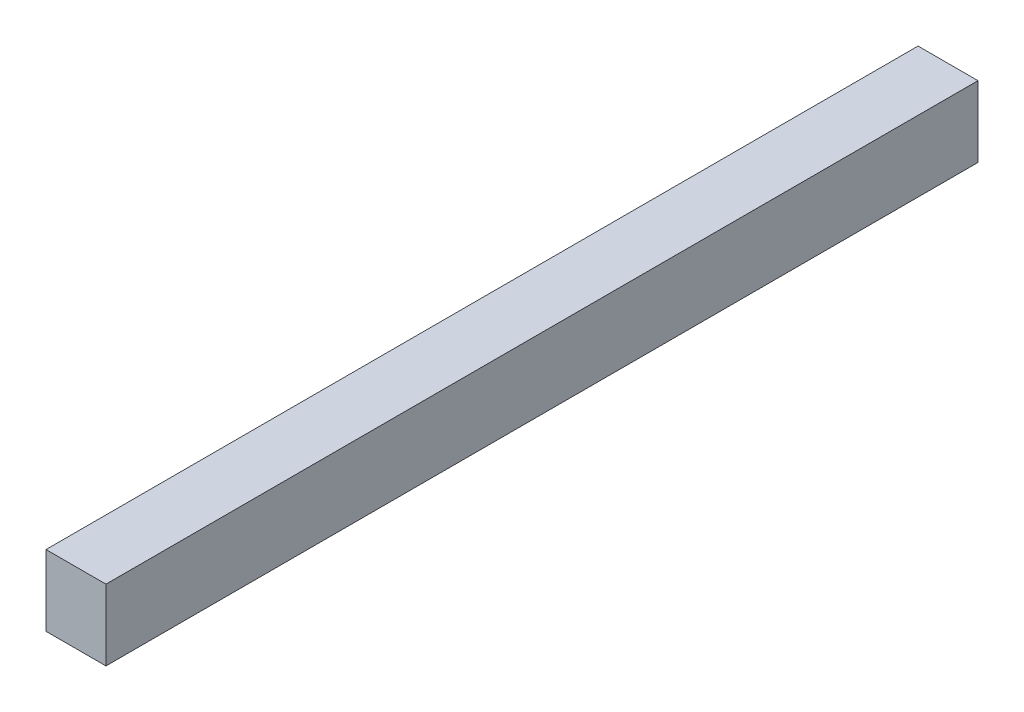
ISO-10303-21;
HEADER;
FILE_DESCRIPTION(('STEP AP214'),'2;1');
FILE_NAME('part.step','',(''),(''),'','','');
FILE_SCHEMA(('AUTOMOTIVE_DESIGN { 1 0 10303 214 1 1 1 1 }'));
ENDSEC;
DATA;
#1=APPLICATION_CONTEXT('core data for automotive mechanical design processes');
#2=APPLICATION_PROTOCOL_DEFINITION('international standard','automotive_design',2000,#1);
#3=PRODUCT_CONTEXT('',#1,'mechanical');
#4=PRODUCT('Part','Part','',(#3));
#5=PRODUCT_RELATED_PRODUCT_CATEGORY('part','',(#4));
#6=PRODUCT_DEFINITION_FORMATION('','',#4);
#7=PRODUCT_DEFINITION_CONTEXT('part definition',#1,'design');
#8=PRODUCT_DEFINITION('design','',#6,#7);
#9=PRODUCT_DEFINITION_SHAPE('','',#8);
#10=(LENGTH_UNIT() NAMED_UNIT(*) SI_UNIT(.MILLI.,.METRE.));
#11=(NAMED_UNIT(*) PLANE_ANGLE_UNIT() SI_UNIT($,.RADIAN.));
#12=(NAMED_UNIT(*) SI_UNIT($,.STERADIAN.) SOLID_ANGLE_UNIT());
#13=UNCERTAINTY_MEASURE_WITH_UNIT(LENGTH_MEASURE(1.E-05),#10,'distance_accuracy_value','');
#14=(GEOMETRIC_REPRESENTATION_CONTEXT(3) GLOBAL_UNCERTAINTY_ASSIGNED_CONTEXT((#13)) GLOBAL_UNIT_ASSIGNED_CONTEXT((#10,
#11,#12)) REPRESENTATION_CONTEXT('',''));
#15=CARTESIAN_POINT('',(0.,0.,0.));
#16=DIRECTION('',(0.,0.,1.));
#17=DIRECTION('',(1.,0.,0.));
#18=AXIS2_PLACEMENT_3D('',#15,#16,#17);
#19=CARTESIAN_POINT('',(1.375,1.625,40.));
#20=DIRECTION('',(-1.,0.,0.));
#21=DIRECTION('',(0.,-1.,0.));
#22=AXIS2_PLACEMENT_3D('',#19,#20,#21);
#23=PLANE('',#22);
#24=DIRECTION('',(0.,1.,0.));
#25=VECTOR('',#24,1.);
#26=CARTESIAN_POINT('',(1.375,1.625,0.));
#27=LINE('',#26,#25);
#28=CARTESIAN_POINT('',(1.375,-1.625,0.));
#29=VERTEX_POINT('',#28);
#30=CARTESIAN_POINT('',(1.375,1.625,0.));
#31=VERTEX_POINT('',#30);
#32=EDGE_CURVE('E107',#29,#31,#27,.T.);
#33=ORIENTED_EDGE('',*,*,#32,.T.);
#34=DIRECTION('',(0.,0.,-1.));
#35=VECTOR('',#34,1.);
#36=CARTESIAN_POINT('',(1.375,1.625,40.));
#37=LINE('',#36,#35);
#38=CARTESIAN_POINT('',(1.375,1.625,40.));
#39=VERTEX_POINT('',#38);
#40=EDGE_CURVE('E11',#39,#31,#37,.T.);
#41=ORIENTED_EDGE('',*,*,#40,.F.);
#42=DIRECTION('',(0.,1.,0.));
#43=VECTOR('',#42,1.);
#44=CARTESIAN_POINT('',(1.375,1.625,40.));
#45=LINE('',#44,#43);
#46=CARTESIAN_POINT('',(1.375,-1.625,40.));
#47=VERTEX_POINT('',#46);
#48=EDGE_CURVE('E91',#47,#39,#45,.T.);
#49=ORIENTED_EDGE('',*,*,#48,.F.);
#50=DIRECTION('',(0.,0.,-1.));
#51=VECTOR('',#50,1.);
#52=CARTESIAN_POINT('',(1.375,-1.625,40.));
#53=LINE('',#52,#51);
#54=EDGE_CURVE('E103',#47,#29,#53,.T.);
#55=ORIENTED_EDGE('',*,*,#54,.T.);
#56=EDGE_LOOP('',(#33,#41,#49,#55));
#57=FACE_BOUND('',#56,.T.);
#58=ADVANCED_FACE('F39',(#57),#23,.F.);
#59=CARTESIAN_POINT('',(-1.375,1.625,40.));
#60=DIRECTION('',(0.,-1.,0.));
#61=DIRECTION('',(0.,0.,-1.));
#62=AXIS2_PLACEMENT_3D('',#59,#60,#61);
#63=PLANE('',#62);
#64=DIRECTION('',(-1.,0.,0.));
#65=VECTOR('',#64,1.);
#66=CARTESIAN_POINT('',(-1.375,1.625,0.));
#67=LINE('',#66,#65);
#68=CARTESIAN_POINT('',(-1.375,1.625,0.));
#69=VERTEX_POINT('',#68);
#70=EDGE_CURVE('E96',#31,#69,#67,.T.);
#71=ORIENTED_EDGE('',*,*,#70,.T.);
#72=DIRECTION('',(0.,0.,-1.));
#73=VECTOR('',#72,1.);
#74=CARTESIAN_POINT('',(-1.375,1.625,40.));
#75=LINE('',#74,#73);
#76=CARTESIAN_POINT('',(-1.375,1.625,40.));
#77=VERTEX_POINT('',#76);
#78=EDGE_CURVE('E48',#77,#69,#75,.T.);
#79=ORIENTED_EDGE('',*,*,#78,.F.);
#80=DIRECTION('',(-1.,0.,0.));
#81=VECTOR('',#80,1.);
#82=CARTESIAN_POINT('',(-1.375,1.625,40.));
#83=LINE('',#82,#81);
#84=EDGE_CURVE('E86',#39,#77,#83,.T.);
#85=ORIENTED_EDGE('',*,*,#84,.F.);
#86=ORIENTED_EDGE('',*,*,#40,.T.);
#87=EDGE_LOOP('',(#71,#79,#85,#86));
#88=FACE_BOUND('',#87,.T.);
#89=ADVANCED_FACE('F95',(#88),#63,.F.);
#90=CARTESIAN_POINT('',(-1.375,1.625,40.));
#91=DIRECTION('',(1.,0.,0.));
#92=DIRECTION('',(0.,1.,0.));
#93=AXIS2_PLACEMENT_3D('',#90,#91,#92);
#94=PLANE('',#93);
#95=DIRECTION('',(0.,-1.,0.));
#96=VECTOR('',#95,1.);
#97=CARTESIAN_POINT('',(-1.375,1.625,0.));
#98=LINE('',#97,#96);
#99=CARTESIAN_POINT('',(-1.375,-1.625,0.));
#100=VERTEX_POINT('',#99);
#101=EDGE_CURVE('E73',#69,#100,#98,.T.);
#102=ORIENTED_EDGE('',*,*,#101,.T.);
#103=DIRECTION('',(0.,0.,-1.));
#104=VECTOR('',#103,1.);
#105=CARTESIAN_POINT('',(-1.375,-1.625,40.));
#106=LINE('',#105,#104);
#107=CARTESIAN_POINT('',(-1.375,-1.625,40.));
#108=VERTEX_POINT('',#107);
#109=EDGE_CURVE('E98',#108,#100,#106,.T.);
#110=ORIENTED_EDGE('',*,*,#109,.F.);
#111=DIRECTION('',(0.,-1.,0.));
#112=VECTOR('',#111,1.);
#113=CARTESIAN_POINT('',(-1.375,1.625,40.));
#114=LINE('',#113,#112);
#115=EDGE_CURVE('E89',#77,#108,#114,.T.);
#116=ORIENTED_EDGE('',*,*,#115,.F.);
#117=ORIENTED_EDGE('',*,*,#78,.T.);
#118=EDGE_LOOP('',(#102,#110,#116,#117));
#119=FACE_BOUND('',#118,.T.);
#120=ADVANCED_FACE('F99',(#119),#94,.F.);
#121=CARTESIAN_POINT('',(-1.375,-1.625,40.));
#122=DIRECTION('',(0.,1.,0.));
#123=DIRECTION('',(0.,0.,1.));
#124=AXIS2_PLACEMENT_3D('',#121,#122,#123);
#125=PLANE('',#124);
#126=DIRECTION('',(1.,0.,0.));
#127=VECTOR('',#126,1.);
#128=CARTESIAN_POINT('',(-1.375,-1.625,0.));
#129=LINE('',#128,#127);
#130=EDGE_CURVE('E79',#100,#29,#129,.T.);
#131=ORIENTED_EDGE('',*,*,#130,.T.);
#132=ORIENTED_EDGE('',*,*,#54,.F.);
#133=DIRECTION('',(1.,0.,0.));
#134=VECTOR('',#133,1.);
#135=CARTESIAN_POINT('',(-1.375,-1.625,40.));
#136=LINE('',#135,#134);
#137=EDGE_CURVE('E56',#108,#47,#136,.T.);
#138=ORIENTED_EDGE('',*,*,#137,.F.);
#139=ORIENTED_EDGE('',*,*,#109,.T.);
#140=EDGE_LOOP('',(#131,#132,#138,#139));
#141=FACE_BOUND('',#140,.T.);
#142=ADVANCED_FACE('F120',(#141),#125,.F.);
#143=CARTESIAN_POINT('',(0.,0.,40.));
#144=DIRECTION('',(0.,0.,1.));
#145=DIRECTION('',(1.,0.,0.));
#146=AXIS2_PLACEMENT_3D('',#143,#144,#145);
#147=PLANE('',#146);
#148=ORIENTED_EDGE('',*,*,#48,.T.);
#149=ORIENTED_EDGE('',*,*,#84,.T.);
#150=ORIENTED_EDGE('',*,*,#115,.T.);
#151=ORIENTED_EDGE('',*,*,#137,.T.);
#152=EDGE_LOOP('',(#148,#149,#150,#151));
#153=FACE_BOUND('',#152,.T.);
#154=ADVANCED_FACE('F87',(#153),#147,.T.);
#155=CARTESIAN_POINT('',(0.,0.,0.));
#156=DIRECTION('',(0.,0.,1.));
#157=DIRECTION('',(1.,0.,0.));
#158=AXIS2_PLACEMENT_3D('',#155,#156,#157);
#159=PLANE('',#158);
#160=ORIENTED_EDGE('',*,*,#32,.F.);
#161=ORIENTED_EDGE('',*,*,#130,.F.);
#162=ORIENTED_EDGE('',*,*,#101,.F.);
#163=ORIENTED_EDGE('',*,*,#70,.F.);
#164=EDGE_LOOP('',(#160,#161,#162,#163));
#165=FACE_BOUND('',#164,.T.);
#166=ADVANCED_FACE('F123',(#165),#159,.F.);
#167=CLOSED_SHELL('',(#58,#89,#120,#142,#154,#166));
#168=MANIFOLD_SOLID_BREP('B2',#167);
#169=ADVANCED_BREP_SHAPE_REPRESENTATION('',(#18,#168),#14);
#170=SHAPE_DEFINITION_REPRESENTATION(#9,#169);
ENDSEC;
END-ISO-10303-21;
